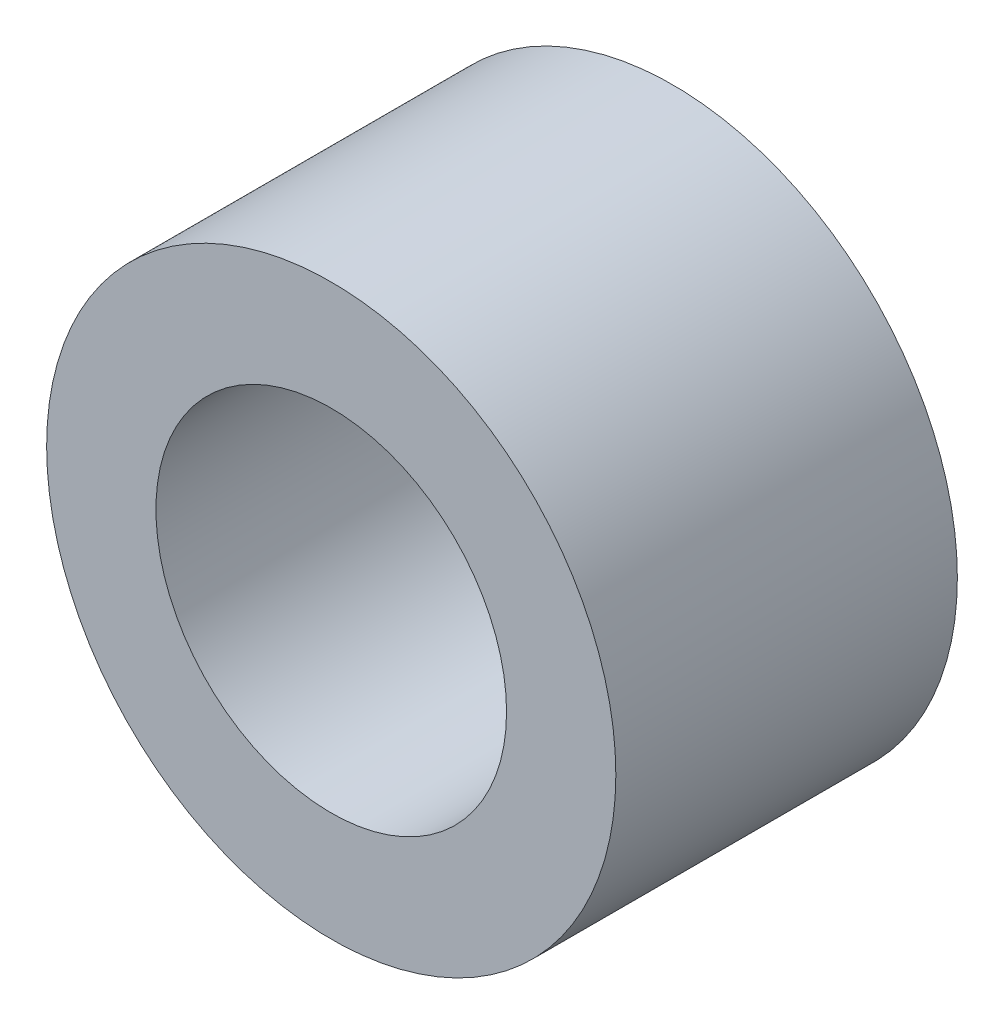
ISO-10303-21;
HEADER;
FILE_DESCRIPTION(('STEP AP214'),'2;1');
FILE_NAME('part.step','',(''),(''),'','','');
FILE_SCHEMA(('AUTOMOTIVE_DESIGN { 1 0 10303 214 1 1 1 1 }'));
ENDSEC;
DATA;
#1=APPLICATION_CONTEXT('core data for automotive mechanical design processes');
#2=APPLICATION_PROTOCOL_DEFINITION('international standard','automotive_design',2000,#1);
#3=PRODUCT_CONTEXT('',#1,'mechanical');
#4=PRODUCT('Part','Part','',(#3));
#5=PRODUCT_RELATED_PRODUCT_CATEGORY('part','',(#4));
#6=PRODUCT_DEFINITION_FORMATION('','',#4);
#7=PRODUCT_DEFINITION_CONTEXT('part definition',#1,'design');
#8=PRODUCT_DEFINITION('design','',#6,#7);
#9=PRODUCT_DEFINITION_SHAPE('','',#8);
#10=(LENGTH_UNIT() NAMED_UNIT(*) SI_UNIT(.MILLI.,.METRE.));
#11=(NAMED_UNIT(*) PLANE_ANGLE_UNIT() SI_UNIT($,.RADIAN.));
#12=(NAMED_UNIT(*) SI_UNIT($,.STERADIAN.) SOLID_ANGLE_UNIT());
#13=UNCERTAINTY_MEASURE_WITH_UNIT(LENGTH_MEASURE(1.E-05),#10,'distance_accuracy_value','');
#14=(GEOMETRIC_REPRESENTATION_CONTEXT(3) GLOBAL_UNCERTAINTY_ASSIGNED_CONTEXT((#13)) GLOBAL_UNIT_ASSIGNED_CONTEXT((#10,
#11,#12)) REPRESENTATION_CONTEXT('',''));
#15=CARTESIAN_POINT('',(0.,0.,0.));
#16=DIRECTION('',(0.,0.,1.));
#17=DIRECTION('',(1.,0.,0.));
#18=AXIS2_PLACEMENT_3D('',#15,#16,#17);
#19=CARTESIAN_POINT('',(0.,0.,9.525));
#20=DIRECTION('',(0.,0.,1.));
#21=DIRECTION('',(1.,0.,0.));
#22=AXIS2_PLACEMENT_3D('',#19,#20,#21);
#23=PLANE('',#22);
#24=CARTESIAN_POINT('',(0.,0.,9.525));
#25=DIRECTION('',(0.,0.,1.));
#26=DIRECTION('',(1.,0.,0.));
#27=AXIS2_PLACEMENT_3D('',#24,#25,#26);
#28=CIRCLE('',#27,7.9375);
#29=CARTESIAN_POINT('',(7.9375,0.,9.525));
#30=VERTEX_POINT('',#29);
#31=EDGE_CURVE('E10',#30,#30,#28,.T.);
#32=ORIENTED_EDGE('',*,*,#31,.T.);
#33=EDGE_LOOP('',(#32));
#34=FACE_BOUND('',#33,.T.);
#35=CARTESIAN_POINT('',(0.,0.,9.525));
#36=DIRECTION('',(0.,0.,1.));
#37=DIRECTION('',(1.,0.,0.));
#38=AXIS2_PLACEMENT_3D('',#35,#36,#37);
#39=CIRCLE('',#38,4.8895);
#40=CARTESIAN_POINT('',(4.8895,0.,9.525));
#41=VERTEX_POINT('',#40);
#42=EDGE_CURVE('E42',#41,#41,#39,.T.);
#43=ORIENTED_EDGE('',*,*,#42,.F.);
#44=EDGE_LOOP('',(#43));
#45=FACE_BOUND('',#44,.T.);
#46=ADVANCED_FACE('F31',(#34,#45),#23,.T.);
#47=CARTESIAN_POINT('',(0.,0.,0.));
#48=DIRECTION('',(0.,0.,1.));
#49=DIRECTION('',(1.,0.,0.));
#50=AXIS2_PLACEMENT_3D('',#47,#48,#49);
#51=PLANE('',#50);
#52=CARTESIAN_POINT('',(0.,0.,0.));
#53=DIRECTION('',(0.,0.,1.));
#54=DIRECTION('',(1.,0.,0.));
#55=AXIS2_PLACEMENT_3D('',#52,#53,#54);
#56=CIRCLE('',#55,7.9375);
#57=CARTESIAN_POINT('',(7.9375,0.,0.));
#58=VERTEX_POINT('',#57);
#59=EDGE_CURVE('E35',#58,#58,#56,.T.);
#60=ORIENTED_EDGE('',*,*,#59,.F.);
#61=EDGE_LOOP('',(#60));
#62=FACE_BOUND('',#61,.T.);
#63=CARTESIAN_POINT('',(0.,0.,0.));
#64=DIRECTION('',(0.,0.,1.));
#65=DIRECTION('',(1.,0.,0.));
#66=AXIS2_PLACEMENT_3D('',#63,#64,#65);
#67=CIRCLE('',#66,4.8895);
#68=CARTESIAN_POINT('',(4.8895,0.,0.));
#69=VERTEX_POINT('',#68);
#70=EDGE_CURVE('E44',#69,#69,#67,.T.);
#71=ORIENTED_EDGE('',*,*,#70,.T.);
#72=EDGE_LOOP('',(#71));
#73=FACE_BOUND('',#72,.T.);
#74=ADVANCED_FACE('F54',(#62,#73),#51,.F.);
#75=CARTESIAN_POINT('',(0.,0.,9.525));
#76=DIRECTION('',(0.,0.,-1.));
#77=DIRECTION('',(-1.,0.,0.));
#78=AXIS2_PLACEMENT_3D('',#75,#76,#77);
#79=CYLINDRICAL_SURFACE('',#78,7.9375);
#80=ORIENTED_EDGE('',*,*,#31,.F.);
#81=EDGE_LOOP('',(#80));
#82=FACE_BOUND('',#81,.T.);
#83=ORIENTED_EDGE('',*,*,#59,.T.);
#84=EDGE_LOOP('',(#83));
#85=FACE_BOUND('',#84,.T.);
#86=ADVANCED_FACE('F33',(#82,#85),#79,.T.);
#87=CARTESIAN_POINT('',(0.,0.,9.525));
#88=DIRECTION('',(0.,0.,-1.));
#89=DIRECTION('',(-1.,0.,0.));
#90=AXIS2_PLACEMENT_3D('',#87,#88,#89);
#91=CYLINDRICAL_SURFACE('',#90,4.8895);
#92=ORIENTED_EDGE('',*,*,#42,.T.);
#93=EDGE_LOOP('',(#92));
#94=FACE_BOUND('',#93,.T.);
#95=ORIENTED_EDGE('',*,*,#70,.F.);
#96=EDGE_LOOP('',(#95));
#97=FACE_BOUND('',#96,.T.);
#98=ADVANCED_FACE('F50',(#94,#97),#91,.F.);
#99=CLOSED_SHELL('',(#46,#74,#86,#98));
#100=MANIFOLD_SOLID_BREP('B2',#99);
#101=ADVANCED_BREP_SHAPE_REPRESENTATION('',(#18,#100),#14);
#102=SHAPE_DEFINITION_REPRESENTATION(#9,#101);
ENDSEC;
END-ISO-10303-21;
